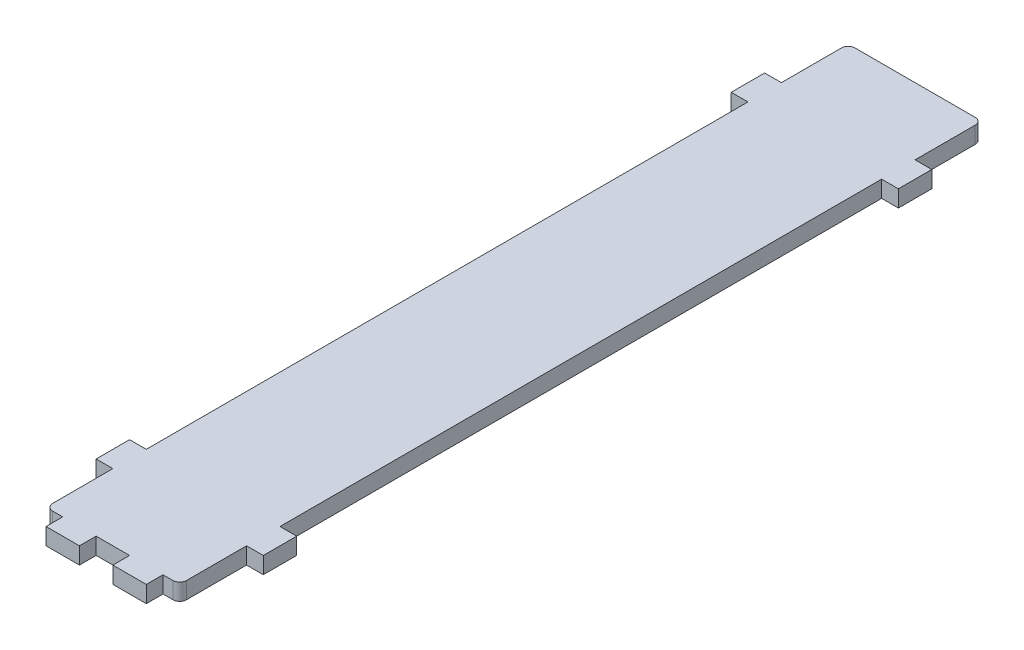
ISO-10303-21;
HEADER;
FILE_DESCRIPTION(('STEP AP214'),'2;1');
FILE_NAME('part.step','',(''),(''),'','','');
FILE_SCHEMA(('AUTOMOTIVE_DESIGN { 1 0 10303 214 1 1 1 1 }'));
ENDSEC;
DATA;
#1=APPLICATION_CONTEXT('core data for automotive mechanical design processes');
#2=APPLICATION_PROTOCOL_DEFINITION('international standard','automotive_design',2000,#1);
#3=PRODUCT_CONTEXT('',#1,'mechanical');
#4=PRODUCT('Part','Part','',(#3));
#5=PRODUCT_RELATED_PRODUCT_CATEGORY('part','',(#4));
#6=PRODUCT_DEFINITION_FORMATION('','',#4);
#7=PRODUCT_DEFINITION_CONTEXT('part definition',#1,'design');
#8=PRODUCT_DEFINITION('design','',#6,#7);
#9=PRODUCT_DEFINITION_SHAPE('','',#8);
#10=(LENGTH_UNIT() NAMED_UNIT(*) SI_UNIT(.MILLI.,.METRE.));
#11=(NAMED_UNIT(*) PLANE_ANGLE_UNIT() SI_UNIT($,.RADIAN.));
#12=(NAMED_UNIT(*) SI_UNIT($,.STERADIAN.) SOLID_ANGLE_UNIT());
#13=UNCERTAINTY_MEASURE_WITH_UNIT(LENGTH_MEASURE(1.E-05),#10,'distance_accuracy_value','');
#14=(GEOMETRIC_REPRESENTATION_CONTEXT(3) GLOBAL_UNCERTAINTY_ASSIGNED_CONTEXT((#13)) GLOBAL_UNIT_ASSIGNED_CONTEXT((#10,
#11,#12)) REPRESENTATION_CONTEXT('',''));
#15=CARTESIAN_POINT('',(0.,0.,0.));
#16=DIRECTION('',(0.,0.,1.));
#17=DIRECTION('',(1.,0.,0.));
#18=AXIS2_PLACEMENT_3D('',#15,#16,#17);
#19=CARTESIAN_POINT('',(0.,6.35,-25.4));
#20=DIRECTION('',(1.,0.,0.));
#21=DIRECTION('',(0.,0.,-1.));
#22=AXIS2_PLACEMENT_3D('',#19,#20,#21);
#23=PLANE('',#22);
#24=DIRECTION('',(0.,0.,1.));
#25=VECTOR('',#24,1.);
#26=CARTESIAN_POINT('',(0.,0.,-25.4));
#27=LINE('',#26,#25);
#28=CARTESIAN_POINT('',(0.,0.,-25.4));
#29=VERTEX_POINT('',#28);
#30=CARTESIAN_POINT('',(0.,0.,-2.54));
#31=VERTEX_POINT('',#30);
#32=EDGE_CURVE('E324',#29,#31,#27,.T.);
#33=ORIENTED_EDGE('',*,*,#32,.T.);
#34=DIRECTION('',(0.,-1.,0.));
#35=VECTOR('',#34,1.);
#36=CARTESIAN_POINT('',(0.,6.35,-2.54));
#37=LINE('',#36,#35);
#38=CARTESIAN_POINT('',(0.,6.35,-2.54));
#39=VERTEX_POINT('',#38);
#40=EDGE_CURVE('E457',#31,#39,#37,.F.);
#41=ORIENTED_EDGE('',*,*,#40,.T.);
#42=DIRECTION('',(0.,0.,1.));
#43=VECTOR('',#42,1.);
#44=CARTESIAN_POINT('',(0.,6.35,-25.4));
#45=LINE('',#44,#43);
#46=CARTESIAN_POINT('',(0.,6.35,-25.4));
#47=VERTEX_POINT('',#46);
#48=EDGE_CURVE('E253',#47,#39,#45,.T.);
#49=ORIENTED_EDGE('',*,*,#48,.F.);
#50=DIRECTION('',(0.,-1.,0.));
#51=VECTOR('',#50,1.);
#52=CARTESIAN_POINT('',(0.,6.35,-25.4));
#53=LINE('',#52,#51);
#54=EDGE_CURVE('E323',#47,#29,#53,.T.);
#55=ORIENTED_EDGE('',*,*,#54,.T.);
#56=EDGE_LOOP('',(#33,#41,#49,#55));
#57=FACE_BOUND('',#56,.T.);
#58=ADVANCED_FACE('F32',(#57),#23,.F.);
#59=CARTESIAN_POINT('',(0.,6.35,0.));
#60=DIRECTION('',(0.,0.,-1.));
#61=DIRECTION('',(-1.,0.,0.));
#62=AXIS2_PLACEMENT_3D('',#59,#60,#61);
#63=PLANE('',#62);
#64=DIRECTION('',(1.,0.,0.));
#65=VECTOR('',#64,1.);
#66=CARTESIAN_POINT('',(0.,6.35,0.));
#67=LINE('',#66,#65);
#68=CARTESIAN_POINT('',(2.54,6.35,0.));
#69=VERTEX_POINT('',#68);
#70=CARTESIAN_POINT('',(6.35,6.35,0.));
#71=VERTEX_POINT('',#70);
#72=EDGE_CURVE('E241',#69,#71,#67,.T.);
#73=ORIENTED_EDGE('',*,*,#72,.F.);
#74=DIRECTION('',(0.,-1.,0.));
#75=VECTOR('',#74,1.);
#76=CARTESIAN_POINT('',(2.54,6.35,0.));
#77=LINE('',#76,#75);
#78=CARTESIAN_POINT('',(2.54,0.,0.));
#79=VERTEX_POINT('',#78);
#80=EDGE_CURVE('E262',#69,#79,#77,.T.);
#81=ORIENTED_EDGE('',*,*,#80,.T.);
#82=DIRECTION('',(1.,0.,0.));
#83=VECTOR('',#82,1.);
#84=CARTESIAN_POINT('',(0.,0.,0.));
#85=LINE('',#84,#83);
#86=CARTESIAN_POINT('',(6.35,0.,0.));
#87=VERTEX_POINT('',#86);
#88=EDGE_CURVE('E259',#79,#87,#85,.T.);
#89=ORIENTED_EDGE('',*,*,#88,.T.);
#90=DIRECTION('',(0.,-1.,0.));
#91=VECTOR('',#90,1.);
#92=CARTESIAN_POINT('',(6.35,6.35,0.));
#93=LINE('',#92,#91);
#94=EDGE_CURVE('E256',#71,#87,#93,.T.);
#95=ORIENTED_EDGE('',*,*,#94,.F.);
#96=EDGE_LOOP('',(#73,#81,#89,#95));
#97=FACE_BOUND('',#96,.T.);
#98=ADVANCED_FACE('F257',(#97),#63,.F.);
#99=CARTESIAN_POINT('',(6.35,6.35,0.));
#100=DIRECTION('',(1.,0.,0.));
#101=DIRECTION('',(0.,0.,-1.));
#102=AXIS2_PLACEMENT_3D('',#99,#100,#101);
#103=PLANE('',#102);
#104=DIRECTION('',(0.,0.,1.));
#105=VECTOR('',#104,1.);
#106=CARTESIAN_POINT('',(6.35,0.,0.));
#107=LINE('',#106,#105);
#108=CARTESIAN_POINT('',(6.35,0.,6.35));
#109=VERTEX_POINT('',#108);
#110=EDGE_CURVE('E328',#87,#109,#107,.T.);
#111=ORIENTED_EDGE('',*,*,#110,.T.);
#112=DIRECTION('',(0.,-1.,0.));
#113=VECTOR('',#112,1.);
#114=CARTESIAN_POINT('',(6.35,6.35,6.35));
#115=LINE('',#114,#113);
#116=CARTESIAN_POINT('',(6.35,6.35,6.35));
#117=VERTEX_POINT('',#116);
#118=EDGE_CURVE('E263',#117,#109,#115,.T.);
#119=ORIENTED_EDGE('',*,*,#118,.F.);
#120=DIRECTION('',(0.,0.,1.));
#121=VECTOR('',#120,1.);
#122=CARTESIAN_POINT('',(6.35,6.35,0.));
#123=LINE('',#122,#121);
#124=EDGE_CURVE('E246',#71,#117,#123,.T.);
#125=ORIENTED_EDGE('',*,*,#124,.F.);
#126=ORIENTED_EDGE('',*,*,#94,.T.);
#127=EDGE_LOOP('',(#111,#119,#125,#126));
#128=FACE_BOUND('',#127,.T.);
#129=ADVANCED_FACE('F265',(#128),#103,.F.);
#130=CARTESIAN_POINT('',(6.35,6.35,6.35));
#131=DIRECTION('',(0.,0.,-1.));
#132=DIRECTION('',(-1.,0.,0.));
#133=AXIS2_PLACEMENT_3D('',#130,#131,#132);
#134=PLANE('',#133);
#135=DIRECTION('',(1.,0.,0.));
#136=VECTOR('',#135,1.);
#137=CARTESIAN_POINT('',(6.35,0.,6.35));
#138=LINE('',#137,#136);
#139=CARTESIAN_POINT('',(19.05,0.,6.35));
#140=VERTEX_POINT('',#139);
#141=EDGE_CURVE('E330',#109,#140,#138,.T.);
#142=ORIENTED_EDGE('',*,*,#141,.T.);
#143=DIRECTION('',(0.,-1.,0.));
#144=VECTOR('',#143,1.);
#145=CARTESIAN_POINT('',(19.05,6.35,6.35));
#146=LINE('',#145,#144);
#147=CARTESIAN_POINT('',(19.05,6.35,6.35));
#148=VERTEX_POINT('',#147);
#149=EDGE_CURVE('E444',#148,#140,#146,.T.);
#150=ORIENTED_EDGE('',*,*,#149,.F.);
#151=DIRECTION('',(1.,0.,0.));
#152=VECTOR('',#151,1.);
#153=CARTESIAN_POINT('',(6.35,6.35,6.35));
#154=LINE('',#153,#152);
#155=EDGE_CURVE('E268',#117,#148,#154,.T.);
#156=ORIENTED_EDGE('',*,*,#155,.F.);
#157=ORIENTED_EDGE('',*,*,#118,.T.);
#158=EDGE_LOOP('',(#142,#150,#156,#157));
#159=FACE_BOUND('',#158,.T.);
#160=ADVANCED_FACE('F538',(#159),#134,.F.);
#161=CARTESIAN_POINT('',(19.05,6.35,6.35));
#162=DIRECTION('',(-1.,0.,0.));
#163=DIRECTION('',(0.,0.,1.));
#164=AXIS2_PLACEMENT_3D('',#161,#162,#163);
#165=PLANE('',#164);
#166=DIRECTION('',(0.,0.,-1.));
#167=VECTOR('',#166,1.);
#168=CARTESIAN_POINT('',(19.05,0.,6.35));
#169=LINE('',#168,#167);
#170=CARTESIAN_POINT('',(19.05,0.,0.));
#171=VERTEX_POINT('',#170);
#172=EDGE_CURVE('E332',#140,#171,#169,.T.);
#173=ORIENTED_EDGE('',*,*,#172,.T.);
#174=DIRECTION('',(0.,-1.,0.));
#175=VECTOR('',#174,1.);
#176=CARTESIAN_POINT('',(19.05,6.35,0.));
#177=LINE('',#176,#175);
#178=CARTESIAN_POINT('',(19.05,6.35,0.));
#179=VERTEX_POINT('',#178);
#180=EDGE_CURVE('E441',#179,#171,#177,.T.);
#181=ORIENTED_EDGE('',*,*,#180,.F.);
#182=DIRECTION('',(0.,0.,-1.));
#183=VECTOR('',#182,1.);
#184=CARTESIAN_POINT('',(19.05,6.35,6.35));
#185=LINE('',#184,#183);
#186=EDGE_CURVE('E270',#148,#179,#185,.T.);
#187=ORIENTED_EDGE('',*,*,#186,.F.);
#188=ORIENTED_EDGE('',*,*,#149,.T.);
#189=EDGE_LOOP('',(#173,#181,#187,#188));
#190=FACE_BOUND('',#189,.T.);
#191=ADVANCED_FACE('F545',(#190),#165,.F.);
#192=CARTESIAN_POINT('',(19.05,6.35,0.));
#193=DIRECTION('',(0.,0.,-1.));
#194=DIRECTION('',(-1.,0.,0.));
#195=AXIS2_PLACEMENT_3D('',#192,#193,#194);
#196=PLANE('',#195);
#197=DIRECTION('',(1.,0.,0.));
#198=VECTOR('',#197,1.);
#199=CARTESIAN_POINT('',(19.05,0.,0.));
#200=LINE('',#199,#198);
#201=CARTESIAN_POINT('',(31.75,0.,0.));
#202=VERTEX_POINT('',#201);
#203=EDGE_CURVE('E334',#171,#202,#200,.T.);
#204=ORIENTED_EDGE('',*,*,#203,.T.);
#205=DIRECTION('',(0.,-1.,0.));
#206=VECTOR('',#205,1.);
#207=CARTESIAN_POINT('',(31.75,6.35,0.));
#208=LINE('',#207,#206);
#209=CARTESIAN_POINT('',(31.75,6.35,0.));
#210=VERTEX_POINT('',#209);
#211=EDGE_CURVE('E438',#210,#202,#208,.T.);
#212=ORIENTED_EDGE('',*,*,#211,.F.);
#213=DIRECTION('',(1.,0.,0.));
#214=VECTOR('',#213,1.);
#215=CARTESIAN_POINT('',(19.05,6.35,0.));
#216=LINE('',#215,#214);
#217=EDGE_CURVE('E275',#179,#210,#216,.T.);
#218=ORIENTED_EDGE('',*,*,#217,.F.);
#219=ORIENTED_EDGE('',*,*,#180,.T.);
#220=EDGE_LOOP('',(#204,#212,#218,#219));
#221=FACE_BOUND('',#220,.T.);
#222=ADVANCED_FACE('F548',(#221),#196,.F.);
#223=CARTESIAN_POINT('',(31.75,6.35,0.));
#224=DIRECTION('',(1.,0.,0.));
#225=DIRECTION('',(0.,0.,-1.));
#226=AXIS2_PLACEMENT_3D('',#223,#224,#225);
#227=PLANE('',#226);
#228=DIRECTION('',(0.,0.,1.));
#229=VECTOR('',#228,1.);
#230=CARTESIAN_POINT('',(31.75,0.,0.));
#231=LINE('',#230,#229);
#232=CARTESIAN_POINT('',(31.75,0.,6.35));
#233=VERTEX_POINT('',#232);
#234=EDGE_CURVE('E336',#202,#233,#231,.T.);
#235=ORIENTED_EDGE('',*,*,#234,.T.);
#236=DIRECTION('',(0.,-1.,0.));
#237=VECTOR('',#236,1.);
#238=CARTESIAN_POINT('',(31.75,6.35,6.35));
#239=LINE('',#238,#237);
#240=CARTESIAN_POINT('',(31.75,6.35,6.35));
#241=VERTEX_POINT('',#240);
#242=EDGE_CURVE('E435',#241,#233,#239,.T.);
#243=ORIENTED_EDGE('',*,*,#242,.F.);
#244=DIRECTION('',(0.,0.,1.));
#245=VECTOR('',#244,1.);
#246=CARTESIAN_POINT('',(31.75,6.35,0.));
#247=LINE('',#246,#245);
#248=EDGE_CURVE('E277',#210,#241,#247,.T.);
#249=ORIENTED_EDGE('',*,*,#248,.F.);
#250=ORIENTED_EDGE('',*,*,#211,.T.);
#251=EDGE_LOOP('',(#235,#243,#249,#250));
#252=FACE_BOUND('',#251,.T.);
#253=ADVANCED_FACE('F553',(#252),#227,.F.);
#254=CARTESIAN_POINT('',(31.75,6.35,6.35));
#255=DIRECTION('',(0.,0.,-1.));
#256=DIRECTION('',(-1.,0.,0.));
#257=AXIS2_PLACEMENT_3D('',#254,#255,#256);
#258=PLANE('',#257);
#259=DIRECTION('',(1.,0.,0.));
#260=VECTOR('',#259,1.);
#261=CARTESIAN_POINT('',(31.75,0.,6.35));
#262=LINE('',#261,#260);
#263=CARTESIAN_POINT('',(44.45,0.,6.35));
#264=VERTEX_POINT('',#263);
#265=EDGE_CURVE('E338',#233,#264,#262,.T.);
#266=ORIENTED_EDGE('',*,*,#265,.T.);
#267=DIRECTION('',(0.,-1.,0.));
#268=VECTOR('',#267,1.);
#269=CARTESIAN_POINT('',(44.45,6.35,6.35));
#270=LINE('',#269,#268);
#271=CARTESIAN_POINT('',(44.45,6.35,6.35));
#272=VERTEX_POINT('',#271);
#273=EDGE_CURVE('E432',#272,#264,#270,.T.);
#274=ORIENTED_EDGE('',*,*,#273,.F.);
#275=DIRECTION('',(1.,0.,0.));
#276=VECTOR('',#275,1.);
#277=CARTESIAN_POINT('',(31.75,6.35,6.35));
#278=LINE('',#277,#276);
#279=EDGE_CURVE('E279',#241,#272,#278,.T.);
#280=ORIENTED_EDGE('',*,*,#279,.F.);
#281=ORIENTED_EDGE('',*,*,#242,.T.);
#282=EDGE_LOOP('',(#266,#274,#280,#281));
#283=FACE_BOUND('',#282,.T.);
#284=ADVANCED_FACE('F559',(#283),#258,.F.);
#285=CARTESIAN_POINT('',(44.45,6.35,6.35));
#286=DIRECTION('',(-1.,0.,0.));
#287=DIRECTION('',(0.,0.,1.));
#288=AXIS2_PLACEMENT_3D('',#285,#286,#287);
#289=PLANE('',#288);
#290=DIRECTION('',(0.,0.,-1.));
#291=VECTOR('',#290,1.);
#292=CARTESIAN_POINT('',(44.45,0.,6.35));
#293=LINE('',#292,#291);
#294=CARTESIAN_POINT('',(44.45,0.,0.));
#295=VERTEX_POINT('',#294);
#296=EDGE_CURVE('E340',#264,#295,#293,.T.);
#297=ORIENTED_EDGE('',*,*,#296,.T.);
#298=DIRECTION('',(0.,-1.,0.));
#299=VECTOR('',#298,1.);
#300=CARTESIAN_POINT('',(44.45,6.35,0.));
#301=LINE('',#300,#299);
#302=CARTESIAN_POINT('',(44.45,6.35,0.));
#303=VERTEX_POINT('',#302);
#304=EDGE_CURVE('E429',#303,#295,#301,.T.);
#305=ORIENTED_EDGE('',*,*,#304,.F.);
#306=DIRECTION('',(0.,0.,-1.));
#307=VECTOR('',#306,1.);
#308=CARTESIAN_POINT('',(44.45,6.35,6.35));
#309=LINE('',#308,#307);
#310=EDGE_CURVE('E281',#272,#303,#309,.T.);
#311=ORIENTED_EDGE('',*,*,#310,.F.);
#312=ORIENTED_EDGE('',*,*,#273,.T.);
#313=EDGE_LOOP('',(#297,#305,#311,#312));
#314=FACE_BOUND('',#313,.T.);
#315=ADVANCED_FACE('F563',(#314),#289,.F.);
#316=CARTESIAN_POINT('',(44.45,6.35,0.));
#317=DIRECTION('',(0.,0.,-1.));
#318=DIRECTION('',(-1.,0.,0.));
#319=AXIS2_PLACEMENT_3D('',#316,#317,#318);
#320=PLANE('',#319);
#321=DIRECTION('',(1.,0.,0.));
#322=VECTOR('',#321,1.);
#323=CARTESIAN_POINT('',(44.45,0.,0.));
#324=LINE('',#323,#322);
#325=CARTESIAN_POINT('',(48.26,0.,0.));
#326=VERTEX_POINT('',#325);
#327=EDGE_CURVE('E342',#295,#326,#324,.T.);
#328=ORIENTED_EDGE('',*,*,#327,.T.);
#329=DIRECTION('',(0.,-1.,0.));
#330=VECTOR('',#329,1.);
#331=CARTESIAN_POINT('',(48.26,6.35,0.));
#332=LINE('',#331,#330);
#333=CARTESIAN_POINT('',(48.26,6.35,0.));
#334=VERTEX_POINT('',#333);
#335=EDGE_CURVE('E468',#326,#334,#332,.F.);
#336=ORIENTED_EDGE('',*,*,#335,.T.);
#337=DIRECTION('',(1.,0.,0.));
#338=VECTOR('',#337,1.);
#339=CARTESIAN_POINT('',(44.45,6.35,0.));
#340=LINE('',#339,#338);
#341=EDGE_CURVE('E283',#303,#334,#340,.T.);
#342=ORIENTED_EDGE('',*,*,#341,.F.);
#343=ORIENTED_EDGE('',*,*,#304,.T.);
#344=EDGE_LOOP('',(#328,#336,#342,#343));
#345=FACE_BOUND('',#344,.T.);
#346=ADVANCED_FACE('F567',(#345),#320,.F.);
#347=CARTESIAN_POINT('',(50.8,6.35,0.));
#348=DIRECTION('',(-1.,0.,0.));
#349=DIRECTION('',(0.,0.,1.));
#350=AXIS2_PLACEMENT_3D('',#347,#348,#349);
#351=PLANE('',#350);
#352=DIRECTION('',(0.,0.,-1.));
#353=VECTOR('',#352,1.);
#354=CARTESIAN_POINT('',(50.8,6.35,0.));
#355=LINE('',#354,#353);
#356=CARTESIAN_POINT('',(50.8,6.35,-2.54));
#357=VERTEX_POINT('',#356);
#358=CARTESIAN_POINT('',(50.8,6.35,-25.4));
#359=VERTEX_POINT('',#358);
#360=EDGE_CURVE('E286',#357,#359,#355,.T.);
#361=ORIENTED_EDGE('',*,*,#360,.F.);
#362=DIRECTION('',(0.,-1.,0.));
#363=VECTOR('',#362,1.);
#364=CARTESIAN_POINT('',(50.8,6.35,-2.54));
#365=LINE('',#364,#363);
#366=CARTESIAN_POINT('',(50.8,0.,-2.54));
#367=VERTEX_POINT('',#366);
#368=EDGE_CURVE('E465',#357,#367,#365,.T.);
#369=ORIENTED_EDGE('',*,*,#368,.T.);
#370=DIRECTION('',(0.,0.,-1.));
#371=VECTOR('',#370,1.);
#372=CARTESIAN_POINT('',(50.8,0.,0.));
#373=LINE('',#372,#371);
#374=CARTESIAN_POINT('',(50.8,0.,-25.4));
#375=VERTEX_POINT('',#374);
#376=EDGE_CURVE('E345',#367,#375,#373,.T.);
#377=ORIENTED_EDGE('',*,*,#376,.T.);
#378=DIRECTION('',(0.,-1.,0.));
#379=VECTOR('',#378,1.);
#380=CARTESIAN_POINT('',(50.8,6.35,-25.4));
#381=LINE('',#380,#379);
#382=EDGE_CURVE('E426',#359,#375,#381,.T.);
#383=ORIENTED_EDGE('',*,*,#382,.F.);
#384=EDGE_LOOP('',(#361,#369,#377,#383));
#385=FACE_BOUND('',#384,.T.);
#386=ADVANCED_FACE('F576',(#385),#351,.F.);
#387=CARTESIAN_POINT('',(50.8,6.35,-25.4));
#388=DIRECTION('',(0.,0.,-1.));
#389=DIRECTION('',(-1.,0.,0.));
#390=AXIS2_PLACEMENT_3D('',#387,#388,#389);
#391=PLANE('',#390);
#392=DIRECTION('',(1.,0.,0.));
#393=VECTOR('',#392,1.);
#394=CARTESIAN_POINT('',(50.8,0.,-25.4));
#395=LINE('',#394,#393);
#396=CARTESIAN_POINT('',(57.15,0.,-25.4));
#397=VERTEX_POINT('',#396);
#398=EDGE_CURVE('E347',#375,#397,#395,.T.);
#399=ORIENTED_EDGE('',*,*,#398,.T.);
#400=DIRECTION('',(0.,-1.,0.));
#401=VECTOR('',#400,1.);
#402=CARTESIAN_POINT('',(57.15,6.35,-25.4));
#403=LINE('',#402,#401);
#404=CARTESIAN_POINT('',(57.15,6.35,-25.4));
#405=VERTEX_POINT('',#404);
#406=EDGE_CURVE('E423',#405,#397,#403,.T.);
#407=ORIENTED_EDGE('',*,*,#406,.F.);
#408=DIRECTION('',(1.,0.,0.));
#409=VECTOR('',#408,1.);
#410=CARTESIAN_POINT('',(50.8,6.35,-25.4));
#411=LINE('',#410,#409);
#412=EDGE_CURVE('E288',#359,#405,#411,.T.);
#413=ORIENTED_EDGE('',*,*,#412,.F.);
#414=ORIENTED_EDGE('',*,*,#382,.T.);
#415=EDGE_LOOP('',(#399,#407,#413,#414));
#416=FACE_BOUND('',#415,.T.);
#417=ADVANCED_FACE('F583',(#416),#391,.F.);
#418=CARTESIAN_POINT('',(57.15,6.35,-25.4));
#419=DIRECTION('',(-1.,0.,0.));
#420=DIRECTION('',(0.,0.,1.));
#421=AXIS2_PLACEMENT_3D('',#418,#419,#420);
#422=PLANE('',#421);
#423=DIRECTION('',(0.,0.,-1.));
#424=VECTOR('',#423,1.);
#425=CARTESIAN_POINT('',(57.15,0.,-25.4));
#426=LINE('',#425,#424);
#427=CARTESIAN_POINT('',(57.15,0.,-38.1));
#428=VERTEX_POINT('',#427);
#429=EDGE_CURVE('E349',#397,#428,#426,.T.);
#430=ORIENTED_EDGE('',*,*,#429,.T.);
#431=DIRECTION('',(0.,-1.,0.));
#432=VECTOR('',#431,1.);
#433=CARTESIAN_POINT('',(57.15,6.35,-38.1));
#434=LINE('',#433,#432);
#435=CARTESIAN_POINT('',(57.15,6.35,-38.1));
#436=VERTEX_POINT('',#435);
#437=EDGE_CURVE('E420',#436,#428,#434,.T.);
#438=ORIENTED_EDGE('',*,*,#437,.F.);
#439=DIRECTION('',(0.,0.,-1.));
#440=VECTOR('',#439,1.);
#441=CARTESIAN_POINT('',(57.15,6.35,-25.4));
#442=LINE('',#441,#440);
#443=EDGE_CURVE('E290',#405,#436,#442,.T.);
#444=ORIENTED_EDGE('',*,*,#443,.F.);
#445=ORIENTED_EDGE('',*,*,#406,.T.);
#446=EDGE_LOOP('',(#430,#438,#444,#445));
#447=FACE_BOUND('',#446,.T.);
#448=ADVANCED_FACE('F587',(#447),#422,.F.);
#449=CARTESIAN_POINT('',(57.15,6.35,-38.1));
#450=DIRECTION('',(0.,0.,1.));
#451=DIRECTION('',(1.,0.,0.));
#452=AXIS2_PLACEMENT_3D('',#449,#450,#451);
#453=PLANE('',#452);
#454=DIRECTION('',(-1.,0.,0.));
#455=VECTOR('',#454,1.);
#456=CARTESIAN_POINT('',(57.15,0.,-38.1));
#457=LINE('',#456,#455);
#458=CARTESIAN_POINT('',(50.8,0.,-38.1));
#459=VERTEX_POINT('',#458);
#460=EDGE_CURVE('E351',#428,#459,#457,.T.);
#461=ORIENTED_EDGE('',*,*,#460,.T.);
#462=DIRECTION('',(0.,-1.,0.));
#463=VECTOR('',#462,1.);
#464=CARTESIAN_POINT('',(50.8,6.35,-38.1));
#465=LINE('',#464,#463);
#466=CARTESIAN_POINT('',(50.8,6.35,-38.1));
#467=VERTEX_POINT('',#466);
#468=EDGE_CURVE('E417',#467,#459,#465,.T.);
#469=ORIENTED_EDGE('',*,*,#468,.F.);
#470=DIRECTION('',(-1.,0.,0.));
#471=VECTOR('',#470,1.);
#472=CARTESIAN_POINT('',(57.15,6.35,-38.1));
#473=LINE('',#472,#471);
#474=EDGE_CURVE('E292',#436,#467,#473,.T.);
#475=ORIENTED_EDGE('',*,*,#474,.F.);
#476=ORIENTED_EDGE('',*,*,#437,.T.);
#477=EDGE_LOOP('',(#461,#469,#475,#476));
#478=FACE_BOUND('',#477,.T.);
#479=ADVANCED_FACE('F594',(#478),#453,.F.);
#480=CARTESIAN_POINT('',(50.8,6.35,-38.1));
#481=DIRECTION('',(-1.,0.,0.));
#482=DIRECTION('',(0.,0.,1.));
#483=AXIS2_PLACEMENT_3D('',#480,#481,#482);
#484=PLANE('',#483);
#485=DIRECTION('',(0.,0.,-1.));
#486=VECTOR('',#485,1.);
#487=CARTESIAN_POINT('',(50.8,0.,-38.1));
#488=LINE('',#487,#486);
#489=CARTESIAN_POINT('',(50.8,0.,-266.7));
#490=VERTEX_POINT('',#489);
#491=EDGE_CURVE('E353',#459,#490,#488,.T.);
#492=ORIENTED_EDGE('',*,*,#491,.T.);
#493=DIRECTION('',(0.,-1.,0.));
#494=VECTOR('',#493,1.);
#495=CARTESIAN_POINT('',(50.8,6.35,-266.7));
#496=LINE('',#495,#494);
#497=CARTESIAN_POINT('',(50.8,6.35,-266.7));
#498=VERTEX_POINT('',#497);
#499=EDGE_CURVE('E414',#498,#490,#496,.T.);
#500=ORIENTED_EDGE('',*,*,#499,.F.);
#501=DIRECTION('',(0.,0.,-1.));
#502=VECTOR('',#501,1.);
#503=CARTESIAN_POINT('',(50.8,6.35,-38.1));
#504=LINE('',#503,#502);
#505=EDGE_CURVE('E294',#467,#498,#504,.T.);
#506=ORIENTED_EDGE('',*,*,#505,.F.);
#507=ORIENTED_EDGE('',*,*,#468,.T.);
#508=EDGE_LOOP('',(#492,#500,#506,#507));
#509=FACE_BOUND('',#508,.T.);
#510=ADVANCED_FACE('F597',(#509),#484,.F.);
#511=CARTESIAN_POINT('',(50.8,6.35,-266.7));
#512=DIRECTION('',(0.,0.,-1.));
#513=DIRECTION('',(-1.,0.,0.));
#514=AXIS2_PLACEMENT_3D('',#511,#512,#513);
#515=PLANE('',#514);
#516=DIRECTION('',(1.,0.,0.));
#517=VECTOR('',#516,1.);
#518=CARTESIAN_POINT('',(50.8,0.,-266.7));
#519=LINE('',#518,#517);
#520=CARTESIAN_POINT('',(57.15,0.,-266.7));
#521=VERTEX_POINT('',#520);
#522=EDGE_CURVE('E355',#490,#521,#519,.T.);
#523=ORIENTED_EDGE('',*,*,#522,.T.);
#524=DIRECTION('',(0.,-1.,0.));
#525=VECTOR('',#524,1.);
#526=CARTESIAN_POINT('',(57.15,6.35,-266.7));
#527=LINE('',#526,#525);
#528=CARTESIAN_POINT('',(57.15,6.35,-266.7));
#529=VERTEX_POINT('',#528);
#530=EDGE_CURVE('E411',#529,#521,#527,.T.);
#531=ORIENTED_EDGE('',*,*,#530,.F.);
#532=DIRECTION('',(1.,0.,0.));
#533=VECTOR('',#532,1.);
#534=CARTESIAN_POINT('',(50.8,6.35,-266.7));
#535=LINE('',#534,#533);
#536=EDGE_CURVE('E296',#498,#529,#535,.T.);
#537=ORIENTED_EDGE('',*,*,#536,.F.);
#538=ORIENTED_EDGE('',*,*,#499,.T.);
#539=EDGE_LOOP('',(#523,#531,#537,#538));
#540=FACE_BOUND('',#539,.T.);
#541=ADVANCED_FACE('F602',(#540),#515,.F.);
#542=CARTESIAN_POINT('',(57.15,6.35,-266.7));
#543=DIRECTION('',(-1.,0.,0.));
#544=DIRECTION('',(0.,0.,1.));
#545=AXIS2_PLACEMENT_3D('',#542,#543,#544);
#546=PLANE('',#545);
#547=DIRECTION('',(0.,0.,-1.));
#548=VECTOR('',#547,1.);
#549=CARTESIAN_POINT('',(57.15,0.,-266.7));
#550=LINE('',#549,#548);
#551=CARTESIAN_POINT('',(57.15,0.,-279.4));
#552=VERTEX_POINT('',#551);
#553=EDGE_CURVE('E357',#521,#552,#550,.T.);
#554=ORIENTED_EDGE('',*,*,#553,.T.);
#555=DIRECTION('',(0.,-1.,0.));
#556=VECTOR('',#555,1.);
#557=CARTESIAN_POINT('',(57.15,6.35,-279.4));
#558=LINE('',#557,#556);
#559=CARTESIAN_POINT('',(57.15,6.35,-279.4));
#560=VERTEX_POINT('',#559);
#561=EDGE_CURVE('E408',#560,#552,#558,.T.);
#562=ORIENTED_EDGE('',*,*,#561,.F.);
#563=DIRECTION('',(0.,0.,-1.));
#564=VECTOR('',#563,1.);
#565=CARTESIAN_POINT('',(57.15,6.35,-266.7));
#566=LINE('',#565,#564);
#567=EDGE_CURVE('E298',#529,#560,#566,.T.);
#568=ORIENTED_EDGE('',*,*,#567,.F.);
#569=ORIENTED_EDGE('',*,*,#530,.T.);
#570=EDGE_LOOP('',(#554,#562,#568,#569));
#571=FACE_BOUND('',#570,.T.);
#572=ADVANCED_FACE('F606',(#571),#546,.F.);
#573=CARTESIAN_POINT('',(57.15,6.35,-279.4));
#574=DIRECTION('',(0.,0.,1.));
#575=DIRECTION('',(1.,0.,0.));
#576=AXIS2_PLACEMENT_3D('',#573,#574,#575);
#577=PLANE('',#576);
#578=DIRECTION('',(-1.,0.,0.));
#579=VECTOR('',#578,1.);
#580=CARTESIAN_POINT('',(57.15,0.,-279.4));
#581=LINE('',#580,#579);
#582=CARTESIAN_POINT('',(50.8,0.,-279.4));
#583=VERTEX_POINT('',#582);
#584=EDGE_CURVE('E359',#552,#583,#581,.T.);
#585=ORIENTED_EDGE('',*,*,#584,.T.);
#586=DIRECTION('',(0.,-1.,0.));
#587=VECTOR('',#586,1.);
#588=CARTESIAN_POINT('',(50.8,6.35,-279.4));
#589=LINE('',#588,#587);
#590=CARTESIAN_POINT('',(50.8,6.35,-279.4));
#591=VERTEX_POINT('',#590);
#592=EDGE_CURVE('E405',#591,#583,#589,.T.);
#593=ORIENTED_EDGE('',*,*,#592,.F.);
#594=DIRECTION('',(-1.,0.,0.));
#595=VECTOR('',#594,1.);
#596=CARTESIAN_POINT('',(57.15,6.35,-279.4));
#597=LINE('',#596,#595);
#598=EDGE_CURVE('E300',#560,#591,#597,.T.);
#599=ORIENTED_EDGE('',*,*,#598,.F.);
#600=ORIENTED_EDGE('',*,*,#561,.T.);
#601=EDGE_LOOP('',(#585,#593,#599,#600));
#602=FACE_BOUND('',#601,.T.);
#603=ADVANCED_FACE('F610',(#602),#577,.F.);
#604=CARTESIAN_POINT('',(50.8,6.35,-279.4));
#605=DIRECTION('',(-1.,0.,0.));
#606=DIRECTION('',(0.,0.,1.));
#607=AXIS2_PLACEMENT_3D('',#604,#605,#606);
#608=PLANE('',#607);
#609=DIRECTION('',(0.,0.,-1.));
#610=VECTOR('',#609,1.);
#611=CARTESIAN_POINT('',(50.8,0.,-279.4));
#612=LINE('',#611,#610);
#613=CARTESIAN_POINT('',(50.8,0.,-302.26));
#614=VERTEX_POINT('',#613);
#615=EDGE_CURVE('E361',#583,#614,#612,.T.);
#616=ORIENTED_EDGE('',*,*,#615,.T.);
#617=DIRECTION('',(0.,-1.,0.));
#618=VECTOR('',#617,1.);
#619=CARTESIAN_POINT('',(50.8,6.35,-302.26));
#620=LINE('',#619,#618);
#621=CARTESIAN_POINT('',(50.8,6.35,-302.26));
#622=VERTEX_POINT('',#621);
#623=EDGE_CURVE('E40',#614,#622,#620,.F.);
#624=ORIENTED_EDGE('',*,*,#623,.T.);
#625=DIRECTION('',(0.,0.,-1.));
#626=VECTOR('',#625,1.);
#627=CARTESIAN_POINT('',(50.8,6.35,-279.4));
#628=LINE('',#627,#626);
#629=EDGE_CURVE('E302',#591,#622,#628,.T.);
#630=ORIENTED_EDGE('',*,*,#629,.F.);
#631=ORIENTED_EDGE('',*,*,#592,.T.);
#632=EDGE_LOOP('',(#616,#624,#630,#631));
#633=FACE_BOUND('',#632,.T.);
#634=ADVANCED_FACE('F476',(#633),#608,.F.);
#635=CARTESIAN_POINT('',(50.8,6.35,-304.8));
#636=DIRECTION('',(0.,0.,1.));
#637=DIRECTION('',(1.,0.,0.));
#638=AXIS2_PLACEMENT_3D('',#635,#636,#637);
#639=PLANE('',#638);
#640=DIRECTION('',(-1.,0.,0.));
#641=VECTOR('',#640,1.);
#642=CARTESIAN_POINT('',(50.8,6.35,-304.8));
#643=LINE('',#642,#641);
#644=CARTESIAN_POINT('',(48.26,6.35,-304.8));
#645=VERTEX_POINT('',#644);
#646=CARTESIAN_POINT('',(2.53999999999999,6.35,-304.8));
#647=VERTEX_POINT('',#646);
#648=EDGE_CURVE('E305',#645,#647,#643,.T.);
#649=ORIENTED_EDGE('',*,*,#648,.F.);
#650=DIRECTION('',(0.,-1.,0.));
#651=VECTOR('',#650,1.);
#652=CARTESIAN_POINT('',(48.26,6.35,-304.8));
#653=LINE('',#652,#651);
#654=CARTESIAN_POINT('',(48.26,0.,-304.8));
#655=VERTEX_POINT('',#654);
#656=EDGE_CURVE('E471',#645,#655,#653,.T.);
#657=ORIENTED_EDGE('',*,*,#656,.T.);
#658=DIRECTION('',(-1.,0.,0.));
#659=VECTOR('',#658,1.);
#660=CARTESIAN_POINT('',(50.8,0.,-304.8));
#661=LINE('',#660,#659);
#662=CARTESIAN_POINT('',(2.53999999999999,0.,-304.8));
#663=VERTEX_POINT('',#662);
#664=EDGE_CURVE('E364',#655,#663,#661,.T.);
#665=ORIENTED_EDGE('',*,*,#664,.T.);
#666=DIRECTION('',(0.,-1.,0.));
#667=VECTOR('',#666,1.);
#668=CARTESIAN_POINT('',(2.53999999999999,6.35,-304.8));
#669=LINE('',#668,#667);
#670=EDGE_CURVE('E55',#663,#647,#669,.F.);
#671=ORIENTED_EDGE('',*,*,#670,.T.);
#672=EDGE_LOOP('',(#649,#657,#665,#671));
#673=FACE_BOUND('',#672,.T.);
#674=ADVANCED_FACE('F485',(#673),#639,.F.);
#675=CARTESIAN_POINT('',(0.,6.35,-304.8));
#676=DIRECTION('',(1.,0.,0.));
#677=DIRECTION('',(0.,0.,-1.));
#678=AXIS2_PLACEMENT_3D('',#675,#676,#677);
#679=PLANE('',#678);
#680=DIRECTION('',(0.,0.,1.));
#681=VECTOR('',#680,1.);
#682=CARTESIAN_POINT('',(0.,6.35,-304.8));
#683=LINE('',#682,#681);
#684=CARTESIAN_POINT('',(0.,6.35,-302.26));
#685=VERTEX_POINT('',#684);
#686=CARTESIAN_POINT('',(0.,6.35,-279.4));
#687=VERTEX_POINT('',#686);
#688=EDGE_CURVE('E307',#685,#687,#683,.T.);
#689=ORIENTED_EDGE('',*,*,#688,.F.);
#690=DIRECTION('',(0.,-1.,0.));
#691=VECTOR('',#690,1.);
#692=CARTESIAN_POINT('',(0.,6.35,-302.26));
#693=LINE('',#692,#691);
#694=CARTESIAN_POINT('',(0.,0.,-302.26));
#695=VERTEX_POINT('',#694);
#696=EDGE_CURVE('E11',#685,#695,#693,.T.);
#697=ORIENTED_EDGE('',*,*,#696,.T.);
#698=DIRECTION('',(0.,0.,1.));
#699=VECTOR('',#698,1.);
#700=CARTESIAN_POINT('',(0.,0.,-304.8));
#701=LINE('',#700,#699);
#702=CARTESIAN_POINT('',(0.,0.,-279.4));
#703=VERTEX_POINT('',#702);
#704=EDGE_CURVE('E366',#695,#703,#701,.T.);
#705=ORIENTED_EDGE('',*,*,#704,.T.);
#706=DIRECTION('',(0.,-1.,0.));
#707=VECTOR('',#706,1.);
#708=CARTESIAN_POINT('',(0.,6.35,-279.4));
#709=LINE('',#708,#707);
#710=EDGE_CURVE('E402',#687,#703,#709,.T.);
#711=ORIENTED_EDGE('',*,*,#710,.F.);
#712=EDGE_LOOP('',(#689,#697,#705,#711));
#713=FACE_BOUND('',#712,.T.);
#714=ADVANCED_FACE('F493',(#713),#679,.F.);
#715=CARTESIAN_POINT('',(0.,6.35,-279.4));
#716=DIRECTION('',(0.,0.,1.));
#717=DIRECTION('',(1.,0.,0.));
#718=AXIS2_PLACEMENT_3D('',#715,#716,#717);
#719=PLANE('',#718);
#720=DIRECTION('',(-1.,0.,0.));
#721=VECTOR('',#720,1.);
#722=CARTESIAN_POINT('',(0.,0.,-279.4));
#723=LINE('',#722,#721);
#724=CARTESIAN_POINT('',(-6.35000000000001,0.,-279.4));
#725=VERTEX_POINT('',#724);
#726=EDGE_CURVE('E368',#703,#725,#723,.T.);
#727=ORIENTED_EDGE('',*,*,#726,.T.);
#728=DIRECTION('',(0.,-1.,0.));
#729=VECTOR('',#728,1.);
#730=CARTESIAN_POINT('',(-6.35000000000001,6.35,-279.4));
#731=LINE('',#730,#729);
#732=CARTESIAN_POINT('',(-6.35000000000001,6.35,-279.4));
#733=VERTEX_POINT('',#732);
#734=EDGE_CURVE('E399',#733,#725,#731,.T.);
#735=ORIENTED_EDGE('',*,*,#734,.F.);
#736=DIRECTION('',(-1.,0.,0.));
#737=VECTOR('',#736,1.);
#738=CARTESIAN_POINT('',(0.,6.35,-279.4));
#739=LINE('',#738,#737);
#740=EDGE_CURVE('E309',#687,#733,#739,.T.);
#741=ORIENTED_EDGE('',*,*,#740,.F.);
#742=ORIENTED_EDGE('',*,*,#710,.T.);
#743=EDGE_LOOP('',(#727,#735,#741,#742));
#744=FACE_BOUND('',#743,.T.);
#745=ADVANCED_FACE('F500',(#744),#719,.F.);
#746=CARTESIAN_POINT('',(-6.35000000000001,6.35,-279.4));
#747=DIRECTION('',(1.,0.,0.));
#748=DIRECTION('',(0.,0.,-1.));
#749=AXIS2_PLACEMENT_3D('',#746,#747,#748);
#750=PLANE('',#749);
#751=DIRECTION('',(0.,0.,1.));
#752=VECTOR('',#751,1.);
#753=CARTESIAN_POINT('',(-6.35000000000001,0.,-279.4));
#754=LINE('',#753,#752);
#755=CARTESIAN_POINT('',(-6.35000000000001,0.,-266.7));
#756=VERTEX_POINT('',#755);
#757=EDGE_CURVE('E370',#725,#756,#754,.T.);
#758=ORIENTED_EDGE('',*,*,#757,.T.);
#759=DIRECTION('',(0.,-1.,0.));
#760=VECTOR('',#759,1.);
#761=CARTESIAN_POINT('',(-6.35000000000001,6.35,-266.7));
#762=LINE('',#761,#760);
#763=CARTESIAN_POINT('',(-6.35000000000001,6.35,-266.7));
#764=VERTEX_POINT('',#763);
#765=EDGE_CURVE('E396',#764,#756,#762,.T.);
#766=ORIENTED_EDGE('',*,*,#765,.F.);
#767=DIRECTION('',(0.,0.,1.));
#768=VECTOR('',#767,1.);
#769=CARTESIAN_POINT('',(-6.35000000000001,6.35,-279.4));
#770=LINE('',#769,#768);
#771=EDGE_CURVE('E311',#733,#764,#770,.T.);
#772=ORIENTED_EDGE('',*,*,#771,.F.);
#773=ORIENTED_EDGE('',*,*,#734,.T.);
#774=EDGE_LOOP('',(#758,#766,#772,#773));
#775=FACE_BOUND('',#774,.T.);
#776=ADVANCED_FACE('F503',(#775),#750,.F.);
#777=CARTESIAN_POINT('',(0.,6.35,-266.7));
#778=DIRECTION('',(0.,0.,-1.));
#779=DIRECTION('',(-1.,0.,0.));
#780=AXIS2_PLACEMENT_3D('',#777,#778,#779);
#781=PLANE('',#780);
#782=DIRECTION('',(1.,0.,0.));
#783=VECTOR('',#782,1.);
#784=CARTESIAN_POINT('',(0.,0.,-266.7));
#785=LINE('',#784,#783);
#786=CARTESIAN_POINT('',(0.,0.,-266.7));
#787=VERTEX_POINT('',#786);
#788=EDGE_CURVE('E372',#756,#787,#785,.T.);
#789=ORIENTED_EDGE('',*,*,#788,.T.);
#790=DIRECTION('',(0.,-1.,0.));
#791=VECTOR('',#790,1.);
#792=CARTESIAN_POINT('',(0.,6.35,-266.7));
#793=LINE('',#792,#791);
#794=CARTESIAN_POINT('',(0.,6.35,-266.7));
#795=VERTEX_POINT('',#794);
#796=EDGE_CURVE('E393',#795,#787,#793,.T.);
#797=ORIENTED_EDGE('',*,*,#796,.F.);
#798=DIRECTION('',(1.,0.,0.));
#799=VECTOR('',#798,1.);
#800=CARTESIAN_POINT('',(0.,6.35,-266.7));
#801=LINE('',#800,#799);
#802=EDGE_CURVE('E313',#764,#795,#801,.T.);
#803=ORIENTED_EDGE('',*,*,#802,.F.);
#804=ORIENTED_EDGE('',*,*,#765,.T.);
#805=EDGE_LOOP('',(#789,#797,#803,#804));
#806=FACE_BOUND('',#805,.T.);
#807=ADVANCED_FACE('F508',(#806),#781,.F.);
#808=CARTESIAN_POINT('',(0.,6.35,-266.7));
#809=DIRECTION('',(1.,0.,0.));
#810=DIRECTION('',(0.,0.,-1.));
#811=AXIS2_PLACEMENT_3D('',#808,#809,#810);
#812=PLANE('',#811);
#813=DIRECTION('',(0.,0.,1.));
#814=VECTOR('',#813,1.);
#815=CARTESIAN_POINT('',(0.,0.,-266.7));
#816=LINE('',#815,#814);
#817=CARTESIAN_POINT('',(0.,0.,-38.1));
#818=VERTEX_POINT('',#817);
#819=EDGE_CURVE('E374',#787,#818,#816,.T.);
#820=ORIENTED_EDGE('',*,*,#819,.T.);
#821=DIRECTION('',(0.,-1.,0.));
#822=VECTOR('',#821,1.);
#823=CARTESIAN_POINT('',(0.,6.35,-38.1));
#824=LINE('',#823,#822);
#825=CARTESIAN_POINT('',(0.,6.35,-38.1));
#826=VERTEX_POINT('',#825);
#827=EDGE_CURVE('E390',#826,#818,#824,.T.);
#828=ORIENTED_EDGE('',*,*,#827,.F.);
#829=DIRECTION('',(0.,0.,1.));
#830=VECTOR('',#829,1.);
#831=CARTESIAN_POINT('',(0.,6.35,-266.7));
#832=LINE('',#831,#830);
#833=EDGE_CURVE('E315',#795,#826,#832,.T.);
#834=ORIENTED_EDGE('',*,*,#833,.F.);
#835=ORIENTED_EDGE('',*,*,#796,.T.);
#836=EDGE_LOOP('',(#820,#828,#834,#835));
#837=FACE_BOUND('',#836,.T.);
#838=ADVANCED_FACE('F514',(#837),#812,.F.);
#839=CARTESIAN_POINT('',(0.,6.35,-38.1));
#840=DIRECTION('',(0.,0.,1.));
#841=DIRECTION('',(1.,0.,0.));
#842=AXIS2_PLACEMENT_3D('',#839,#840,#841);
#843=PLANE('',#842);
#844=DIRECTION('',(-1.,0.,0.));
#845=VECTOR('',#844,1.);
#846=CARTESIAN_POINT('',(0.,0.,-38.1));
#847=LINE('',#846,#845);
#848=CARTESIAN_POINT('',(-6.35,0.,-38.1));
#849=VERTEX_POINT('',#848);
#850=EDGE_CURVE('E376',#818,#849,#847,.T.);
#851=ORIENTED_EDGE('',*,*,#850,.T.);
#852=DIRECTION('',(0.,-1.,0.));
#853=VECTOR('',#852,1.);
#854=CARTESIAN_POINT('',(-6.35,6.35,-38.1));
#855=LINE('',#854,#853);
#856=CARTESIAN_POINT('',(-6.35,6.35,-38.1));
#857=VERTEX_POINT('',#856);
#858=EDGE_CURVE('E387',#857,#849,#855,.T.);
#859=ORIENTED_EDGE('',*,*,#858,.F.);
#860=DIRECTION('',(-1.,0.,0.));
#861=VECTOR('',#860,1.);
#862=CARTESIAN_POINT('',(0.,6.35,-38.1));
#863=LINE('',#862,#861);
#864=EDGE_CURVE('E317',#826,#857,#863,.T.);
#865=ORIENTED_EDGE('',*,*,#864,.F.);
#866=ORIENTED_EDGE('',*,*,#827,.T.);
#867=EDGE_LOOP('',(#851,#859,#865,#866));
#868=FACE_BOUND('',#867,.T.);
#869=ADVANCED_FACE('F518',(#868),#843,.F.);
#870=CARTESIAN_POINT('',(-6.35,6.35,-25.4));
#871=DIRECTION('',(1.,0.,0.));
#872=DIRECTION('',(0.,0.,-1.));
#873=AXIS2_PLACEMENT_3D('',#870,#871,#872);
#874=PLANE('',#873);
#875=DIRECTION('',(0.,0.,1.));
#876=VECTOR('',#875,1.);
#877=CARTESIAN_POINT('',(-6.35,0.,-25.4));
#878=LINE('',#877,#876);
#879=CARTESIAN_POINT('',(-6.35,0.,-25.4));
#880=VERTEX_POINT('',#879);
#881=EDGE_CURVE('E378',#849,#880,#878,.T.);
#882=ORIENTED_EDGE('',*,*,#881,.T.);
#883=DIRECTION('',(0.,-1.,0.));
#884=VECTOR('',#883,1.);
#885=CARTESIAN_POINT('',(-6.35,6.35,-25.4));
#886=LINE('',#885,#884);
#887=CARTESIAN_POINT('',(-6.35,6.35,-25.4));
#888=VERTEX_POINT('',#887);
#889=EDGE_CURVE('E384',#888,#880,#886,.T.);
#890=ORIENTED_EDGE('',*,*,#889,.F.);
#891=DIRECTION('',(0.,0.,1.));
#892=VECTOR('',#891,1.);
#893=CARTESIAN_POINT('',(-6.35,6.35,-25.4));
#894=LINE('',#893,#892);
#895=EDGE_CURVE('E319',#857,#888,#894,.T.);
#896=ORIENTED_EDGE('',*,*,#895,.F.);
#897=ORIENTED_EDGE('',*,*,#858,.T.);
#898=EDGE_LOOP('',(#882,#890,#896,#897));
#899=FACE_BOUND('',#898,.T.);
#900=ADVANCED_FACE('F523',(#899),#874,.F.);
#901=CARTESIAN_POINT('',(0.,6.35,-25.4));
#902=DIRECTION('',(0.,0.,-1.));
#903=DIRECTION('',(-1.,0.,0.));
#904=AXIS2_PLACEMENT_3D('',#901,#902,#903);
#905=PLANE('',#904);
#906=DIRECTION('',(1.,0.,0.));
#907=VECTOR('',#906,1.);
#908=CARTESIAN_POINT('',(0.,0.,-25.4));
#909=LINE('',#908,#907);
#910=EDGE_CURVE('E380',#880,#29,#909,.T.);
#911=ORIENTED_EDGE('',*,*,#910,.T.);
#912=ORIENTED_EDGE('',*,*,#54,.F.);
#913=DIRECTION('',(1.,0.,0.));
#914=VECTOR('',#913,1.);
#915=CARTESIAN_POINT('',(0.,6.35,-25.4));
#916=LINE('',#915,#914);
#917=EDGE_CURVE('E321',#888,#47,#916,.T.);
#918=ORIENTED_EDGE('',*,*,#917,.F.);
#919=ORIENTED_EDGE('',*,*,#889,.T.);
#920=EDGE_LOOP('',(#911,#912,#918,#919));
#921=FACE_BOUND('',#920,.T.);
#922=ADVANCED_FACE('F528',(#921),#905,.F.);
#923=CARTESIAN_POINT('',(0.,6.35,0.));
#924=DIRECTION('',(0.,1.,0.));
#925=DIRECTION('',(0.,0.,1.));
#926=AXIS2_PLACEMENT_3D('',#923,#924,#925);
#927=PLANE('',#926);
#928=ORIENTED_EDGE('',*,*,#48,.T.);
#929=CARTESIAN_POINT('',(2.54,6.35,-2.54));
#930=DIRECTION('',(0.,1.,0.));
#931=DIRECTION('',(0.,0.,1.));
#932=AXIS2_PLACEMENT_3D('',#929,#930,#931);
#933=CIRCLE('',#932,2.54);
#934=EDGE_CURVE('E249',#39,#69,#933,.T.);
#935=ORIENTED_EDGE('',*,*,#934,.T.);
#936=ORIENTED_EDGE('',*,*,#72,.T.);
#937=ORIENTED_EDGE('',*,*,#124,.T.);
#938=ORIENTED_EDGE('',*,*,#155,.T.);
#939=ORIENTED_EDGE('',*,*,#186,.T.);
#940=ORIENTED_EDGE('',*,*,#217,.T.);
#941=ORIENTED_EDGE('',*,*,#248,.T.);
#942=ORIENTED_EDGE('',*,*,#279,.T.);
#943=ORIENTED_EDGE('',*,*,#310,.T.);
#944=ORIENTED_EDGE('',*,*,#341,.T.);
#945=CARTESIAN_POINT('',(48.26,6.35,-2.54));
#946=DIRECTION('',(0.,1.,0.));
#947=DIRECTION('',(0.,0.,1.));
#948=AXIS2_PLACEMENT_3D('',#945,#946,#947);
#949=CIRCLE('',#948,2.54);
#950=EDGE_CURVE('E462',#334,#357,#949,.T.);
#951=ORIENTED_EDGE('',*,*,#950,.T.);
#952=ORIENTED_EDGE('',*,*,#360,.T.);
#953=ORIENTED_EDGE('',*,*,#412,.T.);
#954=ORIENTED_EDGE('',*,*,#443,.T.);
#955=ORIENTED_EDGE('',*,*,#474,.T.);
#956=ORIENTED_EDGE('',*,*,#505,.T.);
#957=ORIENTED_EDGE('',*,*,#536,.T.);
#958=ORIENTED_EDGE('',*,*,#567,.T.);
#959=ORIENTED_EDGE('',*,*,#598,.T.);
#960=ORIENTED_EDGE('',*,*,#629,.T.);
#961=CARTESIAN_POINT('',(48.26,6.35,-302.26));
#962=DIRECTION('',(0.,1.,0.));
#963=DIRECTION('',(0.,0.,1.));
#964=AXIS2_PLACEMENT_3D('',#961,#962,#963);
#965=CIRCLE('',#964,2.54);
#966=EDGE_CURVE('E460',#622,#645,#965,.T.);
#967=ORIENTED_EDGE('',*,*,#966,.T.);
#968=ORIENTED_EDGE('',*,*,#648,.T.);
#969=CARTESIAN_POINT('',(2.53999999999999,6.35,-302.26));
#970=DIRECTION('',(0.,1.,0.));
#971=DIRECTION('',(0.,0.,1.));
#972=AXIS2_PLACEMENT_3D('',#969,#970,#971);
#973=CIRCLE('',#972,2.54);
#974=EDGE_CURVE('E47',#647,#685,#973,.T.);
#975=ORIENTED_EDGE('',*,*,#974,.T.);
#976=ORIENTED_EDGE('',*,*,#688,.T.);
#977=ORIENTED_EDGE('',*,*,#740,.T.);
#978=ORIENTED_EDGE('',*,*,#771,.T.);
#979=ORIENTED_EDGE('',*,*,#802,.T.);
#980=ORIENTED_EDGE('',*,*,#833,.T.);
#981=ORIENTED_EDGE('',*,*,#864,.T.);
#982=ORIENTED_EDGE('',*,*,#895,.T.);
#983=ORIENTED_EDGE('',*,*,#917,.T.);
#984=EDGE_LOOP('',(#928,#935,#936,#937,#938,#939,#940,#941,#942,#943,#944,#951,#952,#953,#954,
#955,#956,#957,#958,#959,#960,#967,#968,#975,#976,#977,#978,#979,#980,#981,#982,#983));
#985=FACE_BOUND('',#984,.T.);
#986=ADVANCED_FACE('F244',(#985),#927,.T.);
#987=CARTESIAN_POINT('',(0.,0.,0.));
#988=DIRECTION('',(0.,1.,0.));
#989=DIRECTION('',(0.,0.,1.));
#990=AXIS2_PLACEMENT_3D('',#987,#988,#989);
#991=PLANE('',#990);
#992=ORIENTED_EDGE('',*,*,#88,.F.);
#993=CARTESIAN_POINT('',(2.54,0.,-2.54));
#994=DIRECTION('',(0.,1.,0.));
#995=DIRECTION('',(0.,0.,1.));
#996=AXIS2_PLACEMENT_3D('',#993,#994,#995);
#997=CIRCLE('',#996,2.54);
#998=EDGE_CURVE('E455',#79,#31,#997,.F.);
#999=ORIENTED_EDGE('',*,*,#998,.T.);
#1000=ORIENTED_EDGE('',*,*,#32,.F.);
#1001=ORIENTED_EDGE('',*,*,#910,.F.);
#1002=ORIENTED_EDGE('',*,*,#881,.F.);
#1003=ORIENTED_EDGE('',*,*,#850,.F.);
#1004=ORIENTED_EDGE('',*,*,#819,.F.);
#1005=ORIENTED_EDGE('',*,*,#788,.F.);
#1006=ORIENTED_EDGE('',*,*,#757,.F.);
#1007=ORIENTED_EDGE('',*,*,#726,.F.);
#1008=ORIENTED_EDGE('',*,*,#704,.F.);
#1009=CARTESIAN_POINT('',(2.53999999999999,0.,-302.26));
#1010=DIRECTION('',(0.,1.,0.));
#1011=DIRECTION('',(0.,0.,1.));
#1012=AXIS2_PLACEMENT_3D('',#1009,#1010,#1011);
#1013=CIRCLE('',#1012,2.54);
#1014=EDGE_CURVE('E449',#695,#663,#1013,.F.);
#1015=ORIENTED_EDGE('',*,*,#1014,.T.);
#1016=ORIENTED_EDGE('',*,*,#664,.F.);
#1017=CARTESIAN_POINT('',(48.26,0.,-302.26));
#1018=DIRECTION('',(0.,1.,0.));
#1019=DIRECTION('',(0.,0.,1.));
#1020=AXIS2_PLACEMENT_3D('',#1017,#1018,#1019);
#1021=CIRCLE('',#1020,2.54);
#1022=EDGE_CURVE('E451',#655,#614,#1021,.F.);
#1023=ORIENTED_EDGE('',*,*,#1022,.T.);
#1024=ORIENTED_EDGE('',*,*,#615,.F.);
#1025=ORIENTED_EDGE('',*,*,#584,.F.);
#1026=ORIENTED_EDGE('',*,*,#553,.F.);
#1027=ORIENTED_EDGE('',*,*,#522,.F.);
#1028=ORIENTED_EDGE('',*,*,#491,.F.);
#1029=ORIENTED_EDGE('',*,*,#460,.F.);
#1030=ORIENTED_EDGE('',*,*,#429,.F.);
#1031=ORIENTED_EDGE('',*,*,#398,.F.);
#1032=ORIENTED_EDGE('',*,*,#376,.F.);
#1033=CARTESIAN_POINT('',(48.26,0.,-2.54));
#1034=DIRECTION('',(0.,1.,0.));
#1035=DIRECTION('',(0.,0.,1.));
#1036=AXIS2_PLACEMENT_3D('',#1033,#1034,#1035);
#1037=CIRCLE('',#1036,2.54);
#1038=EDGE_CURVE('E453',#367,#326,#1037,.F.);
#1039=ORIENTED_EDGE('',*,*,#1038,.T.);
#1040=ORIENTED_EDGE('',*,*,#327,.F.);
#1041=ORIENTED_EDGE('',*,*,#296,.F.);
#1042=ORIENTED_EDGE('',*,*,#265,.F.);
#1043=ORIENTED_EDGE('',*,*,#234,.F.);
#1044=ORIENTED_EDGE('',*,*,#203,.F.);
#1045=ORIENTED_EDGE('',*,*,#172,.F.);
#1046=ORIENTED_EDGE('',*,*,#141,.F.);
#1047=ORIENTED_EDGE('',*,*,#110,.F.);
#1048=EDGE_LOOP('',(#992,#999,#1000,#1001,#1002,#1003,#1004,#1005,#1006,#1007,#1008,#1015,#1016,
#1023,#1024,#1025,#1026,#1027,#1028,#1029,#1030,#1031,#1032,#1039,#1040,#1041,#1042,#1043,#1044,
#1045,#1046,#1047));
#1049=FACE_BOUND('',#1048,.T.);
#1050=ADVANCED_FACE('F487',(#1049),#991,.F.);
#1051=CARTESIAN_POINT('',(2.54,6.35,-2.54));
#1052=DIRECTION('',(0.,-1.,0.));
#1053=DIRECTION('',(0.,0.,-1.));
#1054=AXIS2_PLACEMENT_3D('',#1051,#1052,#1053);
#1055=CYLINDRICAL_SURFACE('',#1054,2.54);
#1056=ORIENTED_EDGE('',*,*,#934,.F.);
#1057=ORIENTED_EDGE('',*,*,#40,.F.);
#1058=ORIENTED_EDGE('',*,*,#998,.F.);
#1059=ORIENTED_EDGE('',*,*,#80,.F.);
#1060=EDGE_LOOP('',(#1056,#1057,#1058,#1059));
#1061=FACE_BOUND('',#1060,.T.);
#1062=ADVANCED_FACE('F534',(#1061),#1055,.T.);
#1063=CARTESIAN_POINT('',(48.26,6.35,-2.54));
#1064=DIRECTION('',(0.,-1.,0.));
#1065=DIRECTION('',(0.,0.,-1.));
#1066=AXIS2_PLACEMENT_3D('',#1063,#1064,#1065);
#1067=CYLINDRICAL_SURFACE('',#1066,2.54);
#1068=ORIENTED_EDGE('',*,*,#950,.F.);
#1069=ORIENTED_EDGE('',*,*,#335,.F.);
#1070=ORIENTED_EDGE('',*,*,#1038,.F.);
#1071=ORIENTED_EDGE('',*,*,#368,.F.);
#1072=EDGE_LOOP('',(#1068,#1069,#1070,#1071));
#1073=FACE_BOUND('',#1072,.T.);
#1074=ADVANCED_FACE('F573',(#1073),#1067,.T.);
#1075=CARTESIAN_POINT('',(48.26,6.35,-302.26));
#1076=DIRECTION('',(0.,-1.,0.));
#1077=DIRECTION('',(0.,0.,-1.));
#1078=AXIS2_PLACEMENT_3D('',#1075,#1076,#1077);
#1079=CYLINDRICAL_SURFACE('',#1078,2.54);
#1080=ORIENTED_EDGE('',*,*,#966,.F.);
#1081=ORIENTED_EDGE('',*,*,#623,.F.);
#1082=ORIENTED_EDGE('',*,*,#1022,.F.);
#1083=ORIENTED_EDGE('',*,*,#656,.F.);
#1084=EDGE_LOOP('',(#1080,#1081,#1082,#1083));
#1085=FACE_BOUND('',#1084,.T.);
#1086=ADVANCED_FACE('F483',(#1085),#1079,.T.);
#1087=CARTESIAN_POINT('',(2.53999999999999,6.35,-302.26));
#1088=DIRECTION('',(0.,-1.,0.));
#1089=DIRECTION('',(0.,0.,-1.));
#1090=AXIS2_PLACEMENT_3D('',#1087,#1088,#1089);
#1091=CYLINDRICAL_SURFACE('',#1090,2.54);
#1092=ORIENTED_EDGE('',*,*,#974,.F.);
#1093=ORIENTED_EDGE('',*,*,#670,.F.);
#1094=ORIENTED_EDGE('',*,*,#1014,.F.);
#1095=ORIENTED_EDGE('',*,*,#696,.F.);
#1096=EDGE_LOOP('',(#1092,#1093,#1094,#1095));
#1097=FACE_BOUND('',#1096,.T.);
#1098=ADVANCED_FACE('F34',(#1097),#1091,.T.);
#1099=CLOSED_SHELL('',(#58,#98,#129,#160,#191,#222,#253,#284,#315,#346,#386,#417,#448,#479,#510,
#541,#572,#603,#634,#674,#714,#745,#776,#807,#838,#869,#900,#922,#986,#1050,#1062,#1074,#1086,#1098));
#1100=MANIFOLD_SOLID_BREP('B2',#1099);
#1101=ADVANCED_BREP_SHAPE_REPRESENTATION('',(#18,#1100),#14);
#1102=SHAPE_DEFINITION_REPRESENTATION(#9,#1101);
ENDSEC;
END-ISO-10303-21;
